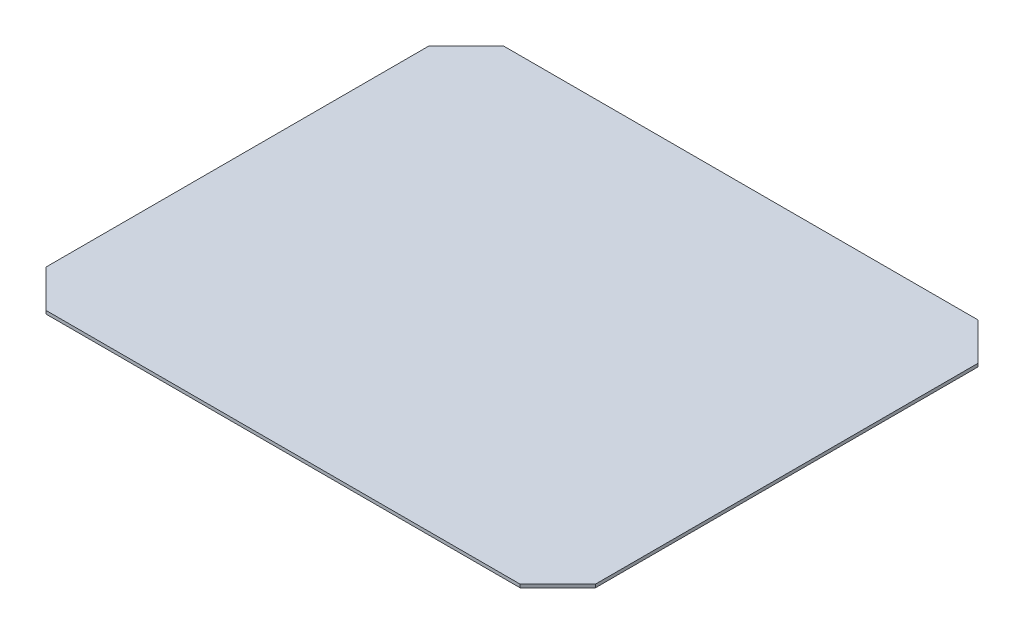
ISO-10303-21;
HEADER;
FILE_DESCRIPTION(('STEP AP214'),'2;1');
FILE_NAME('part.step','',(''),(''),'','','');
FILE_SCHEMA(('AUTOMOTIVE_DESIGN { 1 0 10303 214 1 1 1 1 }'));
ENDSEC;
DATA;
#1=APPLICATION_CONTEXT('core data for automotive mechanical design processes');
#2=APPLICATION_PROTOCOL_DEFINITION('international standard','automotive_design',2000,#1);
#3=PRODUCT_CONTEXT('',#1,'mechanical');
#4=PRODUCT('Part','Part','',(#3));
#5=PRODUCT_RELATED_PRODUCT_CATEGORY('part','',(#4));
#6=PRODUCT_DEFINITION_FORMATION('','',#4);
#7=PRODUCT_DEFINITION_CONTEXT('part definition',#1,'design');
#8=PRODUCT_DEFINITION('design','',#6,#7);
#9=PRODUCT_DEFINITION_SHAPE('','',#8);
#10=(LENGTH_UNIT() NAMED_UNIT(*) SI_UNIT(.MILLI.,.METRE.));
#11=(NAMED_UNIT(*) PLANE_ANGLE_UNIT() SI_UNIT($,.RADIAN.));
#12=(NAMED_UNIT(*) SI_UNIT($,.STERADIAN.) SOLID_ANGLE_UNIT());
#13=UNCERTAINTY_MEASURE_WITH_UNIT(LENGTH_MEASURE(1.E-05),#10,'distance_accuracy_value','');
#14=(GEOMETRIC_REPRESENTATION_CONTEXT(3) GLOBAL_UNCERTAINTY_ASSIGNED_CONTEXT((#13)) GLOBAL_UNIT_ASSIGNED_CONTEXT((#10,
#11,#12)) REPRESENTATION_CONTEXT('',''));
#15=CARTESIAN_POINT('',(0.,0.,0.));
#16=DIRECTION('',(0.,0.,1.));
#17=DIRECTION('',(1.,0.,0.));
#18=AXIS2_PLACEMENT_3D('',#15,#16,#17);
#19=CARTESIAN_POINT('',(-280.,3.5,-230.));
#20=DIRECTION('',(0.,0.,1.));
#21=DIRECTION('',(1.,0.,0.));
#22=AXIS2_PLACEMENT_3D('',#19,#20,#21);
#23=PLANE('',#22);
#24=DIRECTION('',(-1.,0.,0.));
#25=VECTOR('',#24,1.);
#26=CARTESIAN_POINT('',(-280.,0.,-230.));
#27=LINE('',#26,#25);
#28=CARTESIAN_POINT('',(239.,0.,-230.));
#29=VERTEX_POINT('',#28);
#30=CARTESIAN_POINT('',(-279.,0.,-230.));
#31=VERTEX_POINT('',#30);
#32=EDGE_CURVE('E123',#29,#31,#27,.T.);
#33=ORIENTED_EDGE('',*,*,#32,.T.);
#34=DIRECTION('',(0.,1.,0.));
#35=VECTOR('',#34,1.);
#36=CARTESIAN_POINT('',(-279.,0.,-230.));
#37=LINE('',#36,#35);
#38=CARTESIAN_POINT('',(-279.,3.5,-230.));
#39=VERTEX_POINT('',#38);
#40=EDGE_CURVE('E180',#31,#39,#37,.T.);
#41=ORIENTED_EDGE('',*,*,#40,.T.);
#42=DIRECTION('',(-1.,0.,0.));
#43=VECTOR('',#42,1.);
#44=CARTESIAN_POINT('',(260.,3.5,-230.));
#45=LINE('',#44,#43);
#46=CARTESIAN_POINT('',(239.,3.5,-230.));
#47=VERTEX_POINT('',#46);
#48=EDGE_CURVE('E125',#47,#39,#45,.T.);
#49=ORIENTED_EDGE('',*,*,#48,.F.);
#50=DIRECTION('',(0.,1.,0.));
#51=VECTOR('',#50,1.);
#52=CARTESIAN_POINT('',(239.,0.,-230.));
#53=LINE('',#52,#51);
#54=EDGE_CURVE('E108',#29,#47,#53,.T.);
#55=ORIENTED_EDGE('',*,*,#54,.F.);
#56=EDGE_LOOP('',(#33,#41,#49,#55));
#57=FACE_BOUND('',#56,.T.);
#58=ADVANCED_FACE('F39',(#57),#23,.F.);
#59=CARTESIAN_POINT('',(-320.,3.5,250.));
#60=DIRECTION('',(1.,0.,0.));
#61=DIRECTION('',(0.,0.,-1.));
#62=AXIS2_PLACEMENT_3D('',#59,#60,#61);
#63=PLANE('',#62);
#64=DIRECTION('',(0.,0.,1.));
#65=VECTOR('',#64,1.);
#66=CARTESIAN_POINT('',(-320.,3.5,-210.));
#67=LINE('',#66,#65);
#68=CARTESIAN_POINT('',(-320.,3.5,-189.));
#69=VERTEX_POINT('',#68);
#70=CARTESIAN_POINT('',(-320.,3.5,229.));
#71=VERTEX_POINT('',#70);
#72=EDGE_CURVE('E48',#69,#71,#67,.T.);
#73=ORIENTED_EDGE('',*,*,#72,.F.);
#74=DIRECTION('',(0.,1.,0.));
#75=VECTOR('',#74,1.);
#76=CARTESIAN_POINT('',(-320.,0.,-189.));
#77=LINE('',#76,#75);
#78=CARTESIAN_POINT('',(-320.,0.,-189.));
#79=VERTEX_POINT('',#78);
#80=EDGE_CURVE('E174',#79,#69,#77,.T.);
#81=ORIENTED_EDGE('',*,*,#80,.F.);
#82=DIRECTION('',(0.,0.,1.));
#83=VECTOR('',#82,1.);
#84=CARTESIAN_POINT('',(-320.,0.,250.));
#85=LINE('',#84,#83);
#86=CARTESIAN_POINT('',(-320.,0.,229.));
#87=VERTEX_POINT('',#86);
#88=EDGE_CURVE('E134',#79,#87,#85,.T.);
#89=ORIENTED_EDGE('',*,*,#88,.T.);
#90=DIRECTION('',(0.,1.,0.));
#91=VECTOR('',#90,1.);
#92=CARTESIAN_POINT('',(-320.,0.,229.));
#93=LINE('',#92,#91);
#94=EDGE_CURVE('E56',#87,#71,#93,.T.);
#95=ORIENTED_EDGE('',*,*,#94,.T.);
#96=EDGE_LOOP('',(#73,#81,#89,#95));
#97=FACE_BOUND('',#96,.T.);
#98=ADVANCED_FACE('F173',(#97),#63,.F.);
#99=CARTESIAN_POINT('',(260.,3.5,270.));
#100=DIRECTION('',(0.,0.,-1.));
#101=DIRECTION('',(-1.,0.,0.));
#102=AXIS2_PLACEMENT_3D('',#99,#100,#101);
#103=PLANE('',#102);
#104=DIRECTION('',(1.,0.,0.));
#105=VECTOR('',#104,1.);
#106=CARTESIAN_POINT('',(260.,0.,270.));
#107=LINE('',#106,#105);
#108=CARTESIAN_POINT('',(-279.,0.,270.));
#109=VERTEX_POINT('',#108);
#110=CARTESIAN_POINT('',(239.,0.,270.));
#111=VERTEX_POINT('',#110);
#112=EDGE_CURVE('E140',#109,#111,#107,.T.);
#113=ORIENTED_EDGE('',*,*,#112,.T.);
#114=DIRECTION('',(0.,1.,0.));
#115=VECTOR('',#114,1.);
#116=CARTESIAN_POINT('',(239.,0.,270.));
#117=LINE('',#116,#115);
#118=CARTESIAN_POINT('',(239.,3.5,270.));
#119=VERTEX_POINT('',#118);
#120=EDGE_CURVE('E64',#111,#119,#117,.T.);
#121=ORIENTED_EDGE('',*,*,#120,.T.);
#122=DIRECTION('',(1.,0.,0.));
#123=VECTOR('',#122,1.);
#124=CARTESIAN_POINT('',(-280.,3.5,270.));
#125=LINE('',#124,#123);
#126=CARTESIAN_POINT('',(-279.,3.5,270.));
#127=VERTEX_POINT('',#126);
#128=EDGE_CURVE('E11',#127,#119,#125,.T.);
#129=ORIENTED_EDGE('',*,*,#128,.F.);
#130=DIRECTION('',(0.,1.,0.));
#131=VECTOR('',#130,1.);
#132=CARTESIAN_POINT('',(-279.,0.,270.));
#133=LINE('',#132,#131);
#134=EDGE_CURVE('E135',#109,#127,#133,.T.);
#135=ORIENTED_EDGE('',*,*,#134,.F.);
#136=EDGE_LOOP('',(#113,#121,#129,#135));
#137=FACE_BOUND('',#136,.T.);
#138=ADVANCED_FACE('F222',(#137),#103,.F.);
#139=CARTESIAN_POINT('',(280.,3.5,-210.));
#140=DIRECTION('',(-1.,0.,0.));
#141=DIRECTION('',(0.,0.,1.));
#142=AXIS2_PLACEMENT_3D('',#139,#140,#141);
#143=PLANE('',#142);
#144=DIRECTION('',(0.,0.,-1.));
#145=VECTOR('',#144,1.);
#146=CARTESIAN_POINT('',(280.,3.5,-210.));
#147=LINE('',#146,#145);
#148=CARTESIAN_POINT('',(280.,3.5,229.));
#149=VERTEX_POINT('',#148);
#150=CARTESIAN_POINT('',(280.,3.5,-189.));
#151=VERTEX_POINT('',#150);
#152=EDGE_CURVE('E150',#149,#151,#147,.T.);
#153=ORIENTED_EDGE('',*,*,#152,.F.);
#154=DIRECTION('',(0.,1.,0.));
#155=VECTOR('',#154,1.);
#156=CARTESIAN_POINT('',(280.,0.,229.));
#157=LINE('',#156,#155);
#158=CARTESIAN_POINT('',(280.,0.,229.));
#159=VERTEX_POINT('',#158);
#160=EDGE_CURVE('E183',#159,#149,#157,.T.);
#161=ORIENTED_EDGE('',*,*,#160,.F.);
#162=DIRECTION('',(0.,0.,-1.));
#163=VECTOR('',#162,1.);
#164=CARTESIAN_POINT('',(280.,0.,-210.));
#165=LINE('',#164,#163);
#166=CARTESIAN_POINT('',(280.,0.,-189.));
#167=VERTEX_POINT('',#166);
#168=EDGE_CURVE('E42',#159,#167,#165,.T.);
#169=ORIENTED_EDGE('',*,*,#168,.T.);
#170=DIRECTION('',(0.,1.,0.));
#171=VECTOR('',#170,1.);
#172=CARTESIAN_POINT('',(280.,0.,-189.));
#173=LINE('',#172,#171);
#174=EDGE_CURVE('E111',#167,#151,#173,.T.);
#175=ORIENTED_EDGE('',*,*,#174,.T.);
#176=EDGE_LOOP('',(#153,#161,#169,#175));
#177=FACE_BOUND('',#176,.T.);
#178=ADVANCED_FACE('F204',(#177),#143,.F.);
#179=CARTESIAN_POINT('',(0.,3.5,0.));
#180=DIRECTION('',(0.,-1.,0.));
#181=DIRECTION('',(0.,0.,-1.));
#182=AXIS2_PLACEMENT_3D('',#179,#180,#181);
#183=PLANE('',#182);
#184=ORIENTED_EDGE('',*,*,#48,.T.);
#185=DIRECTION('',(0.707106781186547,0.,-0.707106781186548));
#186=VECTOR('',#185,1.);
#187=CARTESIAN_POINT('',(-279.,3.5,-230.));
#188=LINE('',#187,#186);
#189=EDGE_CURVE('E170',#69,#39,#188,.T.);
#190=ORIENTED_EDGE('',*,*,#189,.F.);
#191=ORIENTED_EDGE('',*,*,#72,.T.);
#192=DIRECTION('',(-0.707106781186547,0.,-0.707106781186548));
#193=VECTOR('',#192,1.);
#194=CARTESIAN_POINT('',(-279.,3.5,270.));
#195=LINE('',#194,#193);
#196=EDGE_CURVE('E168',#127,#71,#195,.T.);
#197=ORIENTED_EDGE('',*,*,#196,.F.);
#198=ORIENTED_EDGE('',*,*,#128,.T.);
#199=DIRECTION('',(-0.707106781186548,0.,0.707106781186547));
#200=VECTOR('',#199,1.);
#201=CARTESIAN_POINT('',(239.,3.5,270.));
#202=LINE('',#201,#200);
#203=EDGE_CURVE('E127',#149,#119,#202,.T.);
#204=ORIENTED_EDGE('',*,*,#203,.F.);
#205=ORIENTED_EDGE('',*,*,#152,.T.);
#206=DIRECTION('',(0.707106781186548,0.,0.707106781186547));
#207=VECTOR('',#206,1.);
#208=CARTESIAN_POINT('',(239.,3.5,-230.));
#209=LINE('',#208,#207);
#210=EDGE_CURVE('E117',#47,#151,#209,.T.);
#211=ORIENTED_EDGE('',*,*,#210,.F.);
#212=EDGE_LOOP('',(#184,#190,#191,#197,#198,#204,#205,#211));
#213=FACE_BOUND('',#212,.T.);
#214=ADVANCED_FACE('F167',(#213),#183,.F.);
#215=CARTESIAN_POINT('',(0.,0.,0.));
#216=DIRECTION('',(0.,-1.,0.));
#217=DIRECTION('',(0.,0.,-1.));
#218=AXIS2_PLACEMENT_3D('',#215,#216,#217);
#219=PLANE('',#218);
#220=DIRECTION('',(0.707106781186547,0.,-0.707106781186548));
#221=VECTOR('',#220,1.);
#222=CARTESIAN_POINT('',(-279.,0.,-230.));
#223=LINE('',#222,#221);
#224=EDGE_CURVE('E132',#79,#31,#223,.T.);
#225=ORIENTED_EDGE('',*,*,#224,.T.);
#226=ORIENTED_EDGE('',*,*,#32,.F.);
#227=DIRECTION('',(0.707106781186548,0.,0.707106781186547));
#228=VECTOR('',#227,1.);
#229=CARTESIAN_POINT('',(239.,0.,-230.));
#230=LINE('',#229,#228);
#231=EDGE_CURVE('E105',#29,#167,#230,.T.);
#232=ORIENTED_EDGE('',*,*,#231,.T.);
#233=ORIENTED_EDGE('',*,*,#168,.F.);
#234=DIRECTION('',(-0.707106781186548,0.,0.707106781186547));
#235=VECTOR('',#234,1.);
#236=CARTESIAN_POINT('',(239.,0.,270.));
#237=LINE('',#236,#235);
#238=EDGE_CURVE('E186',#159,#111,#237,.T.);
#239=ORIENTED_EDGE('',*,*,#238,.T.);
#240=ORIENTED_EDGE('',*,*,#112,.F.);
#241=DIRECTION('',(-0.707106781186547,0.,-0.707106781186548));
#242=VECTOR('',#241,1.);
#243=CARTESIAN_POINT('',(-279.,0.,270.));
#244=LINE('',#243,#242);
#245=EDGE_CURVE('E176',#109,#87,#244,.T.);
#246=ORIENTED_EDGE('',*,*,#245,.T.);
#247=ORIENTED_EDGE('',*,*,#88,.F.);
#248=EDGE_LOOP('',(#225,#226,#232,#233,#239,#240,#246,#247));
#249=FACE_BOUND('',#248,.T.);
#250=ADVANCED_FACE('F130',(#249),#219,.T.);
#251=CARTESIAN_POINT('',(-279.,0.,270.));
#252=DIRECTION('',(0.707106781186548,0.,-0.707106781186547));
#253=DIRECTION('',(-0.707106781186547,0.,-0.707106781186548));
#254=AXIS2_PLACEMENT_3D('',#251,#252,#253);
#255=PLANE('',#254);
#256=ORIENTED_EDGE('',*,*,#196,.T.);
#257=ORIENTED_EDGE('',*,*,#94,.F.);
#258=ORIENTED_EDGE('',*,*,#245,.F.);
#259=ORIENTED_EDGE('',*,*,#134,.T.);
#260=EDGE_LOOP('',(#256,#257,#258,#259));
#261=FACE_BOUND('',#260,.T.);
#262=ADVANCED_FACE('F215',(#261),#255,.F.);
#263=CARTESIAN_POINT('',(239.,0.,-230.));
#264=DIRECTION('',(-0.707106781186547,0.,0.707106781186548));
#265=DIRECTION('',(0.707106781186548,0.,0.707106781186547));
#266=AXIS2_PLACEMENT_3D('',#263,#264,#265);
#267=PLANE('',#266);
#268=ORIENTED_EDGE('',*,*,#210,.T.);
#269=ORIENTED_EDGE('',*,*,#174,.F.);
#270=ORIENTED_EDGE('',*,*,#231,.F.);
#271=ORIENTED_EDGE('',*,*,#54,.T.);
#272=EDGE_LOOP('',(#268,#269,#270,#271));
#273=FACE_BOUND('',#272,.T.);
#274=ADVANCED_FACE('F107',(#273),#267,.F.);
#275=CARTESIAN_POINT('',(239.,0.,270.));
#276=DIRECTION('',(-0.707106781186547,0.,-0.707106781186548));
#277=DIRECTION('',(-0.707106781186548,0.,0.707106781186547));
#278=AXIS2_PLACEMENT_3D('',#275,#276,#277);
#279=PLANE('',#278);
#280=ORIENTED_EDGE('',*,*,#203,.T.);
#281=ORIENTED_EDGE('',*,*,#120,.F.);
#282=ORIENTED_EDGE('',*,*,#238,.F.);
#283=ORIENTED_EDGE('',*,*,#160,.T.);
#284=EDGE_LOOP('',(#280,#281,#282,#283));
#285=FACE_BOUND('',#284,.T.);
#286=ADVANCED_FACE('F205',(#285),#279,.F.);
#287=CARTESIAN_POINT('',(-279.,0.,-230.));
#288=DIRECTION('',(0.707106781186548,0.,0.707106781186547));
#289=DIRECTION('',(0.707106781186547,0.,-0.707106781186548));
#290=AXIS2_PLACEMENT_3D('',#287,#288,#289);
#291=PLANE('',#290);
#292=ORIENTED_EDGE('',*,*,#189,.T.);
#293=ORIENTED_EDGE('',*,*,#40,.F.);
#294=ORIENTED_EDGE('',*,*,#224,.F.);
#295=ORIENTED_EDGE('',*,*,#80,.T.);
#296=EDGE_LOOP('',(#292,#293,#294,#295));
#297=FACE_BOUND('',#296,.T.);
#298=ADVANCED_FACE('F207',(#297),#291,.F.);
#299=CLOSED_SHELL('',(#58,#98,#138,#178,#214,#250,#262,#274,#286,#298));
#300=MANIFOLD_SOLID_BREP('B2',#299);
#301=ADVANCED_BREP_SHAPE_REPRESENTATION('',(#18,#300),#14);
#302=SHAPE_DEFINITION_REPRESENTATION(#9,#301);
ENDSEC;
END-ISO-10303-21;
